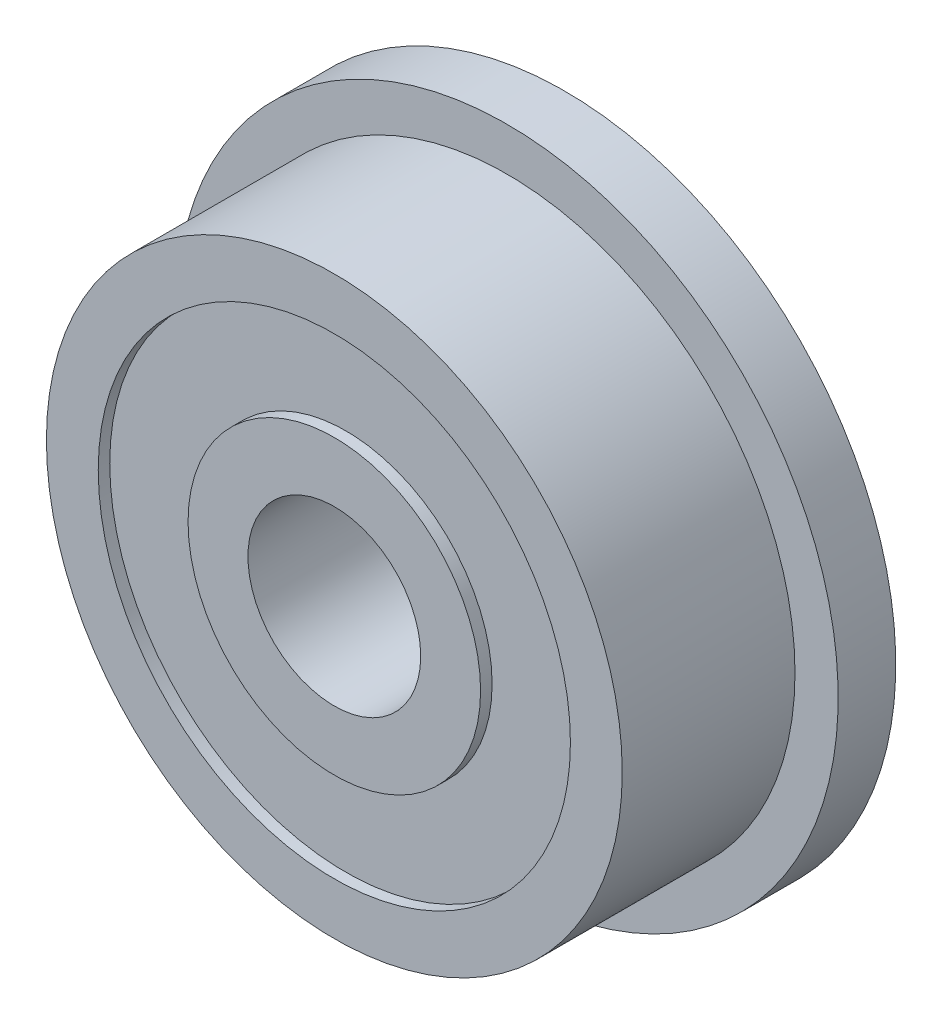
ISO-10303-21;
HEADER;
FILE_DESCRIPTION(('STEP AP214'),'2;1');
FILE_NAME('part.step','',(''),(''),'','','');
FILE_SCHEMA(('AUTOMOTIVE_DESIGN { 1 0 10303 214 1 1 1 1 }'));
ENDSEC;
DATA;
#1=APPLICATION_CONTEXT('core data for automotive mechanical design processes');
#2=APPLICATION_PROTOCOL_DEFINITION('international standard','automotive_design',2000,#1);
#3=PRODUCT_CONTEXT('',#1,'mechanical');
#4=PRODUCT('Part','Part','',(#3));
#5=PRODUCT_RELATED_PRODUCT_CATEGORY('part','',(#4));
#6=PRODUCT_DEFINITION_FORMATION('','',#4);
#7=PRODUCT_DEFINITION_CONTEXT('part definition',#1,'design');
#8=PRODUCT_DEFINITION('design','',#6,#7);
#9=PRODUCT_DEFINITION_SHAPE('','',#8);
#10=(LENGTH_UNIT() NAMED_UNIT(*) SI_UNIT(.MILLI.,.METRE.));
#11=(NAMED_UNIT(*) PLANE_ANGLE_UNIT() SI_UNIT($,.RADIAN.));
#12=(NAMED_UNIT(*) SI_UNIT($,.STERADIAN.) SOLID_ANGLE_UNIT());
#13=UNCERTAINTY_MEASURE_WITH_UNIT(LENGTH_MEASURE(1.E-05),#10,'distance_accuracy_value','');
#14=(GEOMETRIC_REPRESENTATION_CONTEXT(3) GLOBAL_UNCERTAINTY_ASSIGNED_CONTEXT((#13)) GLOBAL_UNIT_ASSIGNED_CONTEXT((#10,
#11,#12)) REPRESENTATION_CONTEXT('',''));
#15=CARTESIAN_POINT('',(0.,0.,0.));
#16=DIRECTION('',(0.,0.,1.));
#17=DIRECTION('',(1.,0.,0.));
#18=AXIS2_PLACEMENT_3D('',#15,#16,#17);
#19=CARTESIAN_POINT('',(0.,0.,-2.));
#20=DIRECTION('',(0.,0.,1.));
#21=DIRECTION('',(1.,0.,0.));
#22=AXIS2_PLACEMENT_3D('',#19,#20,#21);
#23=PLANE('',#22);
#24=CARTESIAN_POINT('',(0.,0.,-2.));
#25=DIRECTION('',(0.,0.,1.));
#26=DIRECTION('',(1.,0.,0.));
#27=AXIS2_PLACEMENT_3D('',#24,#25,#26);
#28=CIRCLE('',#27,1.5);
#29=CARTESIAN_POINT('',(1.5,0.,-2.));
#30=VERTEX_POINT('',#29);
#31=EDGE_CURVE('E49',#30,#30,#28,.T.);
#32=ORIENTED_EDGE('',*,*,#31,.T.);
#33=EDGE_LOOP('',(#32));
#34=FACE_BOUND('',#33,.T.);
#35=CARTESIAN_POINT('',(0.,0.,-2.));
#36=DIRECTION('',(0.,0.,1.));
#37=DIRECTION('',(1.,0.,0.));
#38=AXIS2_PLACEMENT_3D('',#35,#36,#37);
#39=CIRCLE('',#38,2.54);
#40=CARTESIAN_POINT('',(2.54,0.,-2.));
#41=VERTEX_POINT('',#40);
#42=EDGE_CURVE('E75',#41,#41,#39,.T.);
#43=ORIENTED_EDGE('',*,*,#42,.F.);
#44=EDGE_LOOP('',(#43));
#45=FACE_BOUND('',#44,.T.);
#46=ADVANCED_FACE('F30',(#34,#45),#23,.F.);
#47=CARTESIAN_POINT('',(0.,0.,2.));
#48=DIRECTION('',(0.,0.,1.));
#49=DIRECTION('',(1.,0.,0.));
#50=AXIS2_PLACEMENT_3D('',#47,#48,#49);
#51=PLANE('',#50);
#52=CARTESIAN_POINT('',(0.,0.,2.));
#53=DIRECTION('',(0.,0.,1.));
#54=DIRECTION('',(1.,0.,0.));
#55=AXIS2_PLACEMENT_3D('',#52,#53,#54);
#56=CIRCLE('',#55,1.5);
#57=CARTESIAN_POINT('',(1.5,0.,2.));
#58=VERTEX_POINT('',#57);
#59=EDGE_CURVE('E51',#58,#58,#56,.T.);
#60=ORIENTED_EDGE('',*,*,#59,.F.);
#61=EDGE_LOOP('',(#60));
#62=FACE_BOUND('',#61,.T.);
#63=CARTESIAN_POINT('',(0.,0.,2.));
#64=DIRECTION('',(0.,0.,1.));
#65=DIRECTION('',(1.,0.,0.));
#66=AXIS2_PLACEMENT_3D('',#63,#64,#65);
#67=CIRCLE('',#66,2.54);
#68=CARTESIAN_POINT('',(2.54,0.,2.));
#69=VERTEX_POINT('',#68);
#70=EDGE_CURVE('E63',#69,#69,#67,.T.);
#71=ORIENTED_EDGE('',*,*,#70,.T.);
#72=EDGE_LOOP('',(#71));
#73=FACE_BOUND('',#72,.T.);
#74=ADVANCED_FACE('F91',(#62,#73),#51,.T.);
#75=CARTESIAN_POINT('',(0.,0.,2.));
#76=DIRECTION('',(0.,0.,-1.));
#77=DIRECTION('',(-1.,0.,0.));
#78=AXIS2_PLACEMENT_3D('',#75,#76,#77);
#79=CYLINDRICAL_SURFACE('',#78,5.);
#80=CARTESIAN_POINT('',(0.,0.,2.));
#81=DIRECTION('',(0.,0.,1.));
#82=DIRECTION('',(1.,0.,0.));
#83=AXIS2_PLACEMENT_3D('',#80,#81,#82);
#84=CIRCLE('',#83,5.);
#85=CARTESIAN_POINT('',(5.,0.,2.));
#86=VERTEX_POINT('',#85);
#87=EDGE_CURVE('E37',#86,#86,#84,.T.);
#88=ORIENTED_EDGE('',*,*,#87,.F.);
#89=EDGE_LOOP('',(#88));
#90=FACE_BOUND('',#89,.T.);
#91=CARTESIAN_POINT('',(0.,0.,-1.));
#92=DIRECTION('',(0.,0.,-1.));
#93=DIRECTION('',(-1.,0.,0.));
#94=AXIS2_PLACEMENT_3D('',#91,#92,#93);
#95=CIRCLE('',#94,5.);
#96=CARTESIAN_POINT('',(-5.,0.,-1.));
#97=VERTEX_POINT('',#96);
#98=EDGE_CURVE('E10',#97,#97,#95,.T.);
#99=ORIENTED_EDGE('',*,*,#98,.F.);
#100=EDGE_LOOP('',(#99));
#101=FACE_BOUND('',#100,.T.);
#102=ADVANCED_FACE('F32',(#90,#101),#79,.T.);
#103=CARTESIAN_POINT('',(0.,0.,2.));
#104=DIRECTION('',(0.,0.,1.));
#105=DIRECTION('',(1.,0.,0.));
#106=AXIS2_PLACEMENT_3D('',#103,#104,#105);
#107=CIRCLE('',#106,4.1);
#108=CARTESIAN_POINT('',(4.1,0.,2.));
#109=VERTEX_POINT('',#108);
#110=EDGE_CURVE('E57',#109,#109,#107,.T.);
#111=ORIENTED_EDGE('',*,*,#110,.F.);
#112=EDGE_LOOP('',(#111));
#113=FACE_BOUND('',#112,.T.);
#114=ORIENTED_EDGE('',*,*,#87,.T.);
#115=EDGE_LOOP('',(#114));
#116=FACE_BOUND('',#115,.T.);
#117=ADVANCED_FACE('F99',(#113,#116),#51,.T.);
#118=CARTESIAN_POINT('',(0.,0.,-1.));
#119=DIRECTION('',(0.,0.,-1.));
#120=DIRECTION('',(-1.,0.,0.));
#121=AXIS2_PLACEMENT_3D('',#118,#119,#120);
#122=CYLINDRICAL_SURFACE('',#121,5.75);
#123=CARTESIAN_POINT('',(0.,0.,-1.));
#124=DIRECTION('',(0.,0.,-1.));
#125=DIRECTION('',(-1.,0.,0.));
#126=AXIS2_PLACEMENT_3D('',#123,#124,#125);
#127=CIRCLE('',#126,5.75);
#128=CARTESIAN_POINT('',(-5.75,0.,-1.));
#129=VERTEX_POINT('',#128);
#130=EDGE_CURVE('E41',#129,#129,#127,.T.);
#131=ORIENTED_EDGE('',*,*,#130,.T.);
#132=EDGE_LOOP('',(#131));
#133=FACE_BOUND('',#132,.T.);
#134=CARTESIAN_POINT('',(0.,0.,-2.));
#135=DIRECTION('',(0.,0.,-1.));
#136=DIRECTION('',(-1.,0.,0.));
#137=AXIS2_PLACEMENT_3D('',#134,#135,#136);
#138=CIRCLE('',#137,5.75);
#139=CARTESIAN_POINT('',(-5.75,0.,-2.));
#140=VERTEX_POINT('',#139);
#141=EDGE_CURVE('E45',#140,#140,#138,.T.);
#142=ORIENTED_EDGE('',*,*,#141,.F.);
#143=EDGE_LOOP('',(#142));
#144=FACE_BOUND('',#143,.T.);
#145=ADVANCED_FACE('F111',(#133,#144),#122,.T.);
#146=CARTESIAN_POINT('',(0.,0.,-1.));
#147=DIRECTION('',(0.,0.,-1.));
#148=DIRECTION('',(-1.,0.,0.));
#149=AXIS2_PLACEMENT_3D('',#146,#147,#148);
#150=PLANE('',#149);
#151=ORIENTED_EDGE('',*,*,#98,.T.);
#152=EDGE_LOOP('',(#151));
#153=FACE_BOUND('',#152,.T.);
#154=ORIENTED_EDGE('',*,*,#130,.F.);
#155=EDGE_LOOP('',(#154));
#156=FACE_BOUND('',#155,.T.);
#157=ADVANCED_FACE('F102',(#153,#156),#150,.F.);
#158=CARTESIAN_POINT('',(0.,0.,-2.));
#159=DIRECTION('',(0.,0.,1.));
#160=DIRECTION('',(1.,0.,0.));
#161=AXIS2_PLACEMENT_3D('',#158,#159,#160);
#162=CIRCLE('',#161,4.1);
#163=CARTESIAN_POINT('',(4.1,0.,-2.));
#164=VERTEX_POINT('',#163);
#165=EDGE_CURVE('E69',#164,#164,#162,.T.);
#166=ORIENTED_EDGE('',*,*,#165,.T.);
#167=EDGE_LOOP('',(#166));
#168=FACE_BOUND('',#167,.T.);
#169=ORIENTED_EDGE('',*,*,#141,.T.);
#170=EDGE_LOOP('',(#169));
#171=FACE_BOUND('',#170,.T.);
#172=ADVANCED_FACE('F93',(#168,#171),#23,.F.);
#173=CARTESIAN_POINT('',(0.,0.,-2.));
#174=DIRECTION('',(0.,0.,1.));
#175=DIRECTION('',(1.,0.,0.));
#176=AXIS2_PLACEMENT_3D('',#173,#174,#175);
#177=CYLINDRICAL_SURFACE('',#176,1.5);
#178=ORIENTED_EDGE('',*,*,#31,.F.);
#179=EDGE_LOOP('',(#178));
#180=FACE_BOUND('',#179,.T.);
#181=ORIENTED_EDGE('',*,*,#59,.T.);
#182=EDGE_LOOP('',(#181));
#183=FACE_BOUND('',#182,.T.);
#184=ADVANCED_FACE('F101',(#180,#183),#177,.F.);
#185=CARTESIAN_POINT('',(0.,0.,1.8));
#186=DIRECTION('',(0.,0.,1.));
#187=DIRECTION('',(1.,0.,0.));
#188=AXIS2_PLACEMENT_3D('',#185,#186,#187);
#189=CYLINDRICAL_SURFACE('',#188,4.1);
#190=CARTESIAN_POINT('',(0.,0.,1.8));
#191=DIRECTION('',(0.,0.,1.));
#192=DIRECTION('',(1.,0.,0.));
#193=AXIS2_PLACEMENT_3D('',#190,#191,#192);
#194=CIRCLE('',#193,4.1);
#195=CARTESIAN_POINT('',(4.1,0.,1.8));
#196=VERTEX_POINT('',#195);
#197=EDGE_CURVE('E54',#196,#196,#194,.T.);
#198=ORIENTED_EDGE('',*,*,#197,.F.);
#199=EDGE_LOOP('',(#198));
#200=FACE_BOUND('',#199,.T.);
#201=ORIENTED_EDGE('',*,*,#110,.T.);
#202=EDGE_LOOP('',(#201));
#203=FACE_BOUND('',#202,.T.);
#204=ADVANCED_FACE('F108',(#200,#203),#189,.F.);
#205=CARTESIAN_POINT('',(0.,0.,1.8));
#206=DIRECTION('',(0.,0.,1.));
#207=DIRECTION('',(1.,0.,0.));
#208=AXIS2_PLACEMENT_3D('',#205,#206,#207);
#209=PLANE('',#208);
#210=CARTESIAN_POINT('',(0.,0.,1.8));
#211=DIRECTION('',(0.,0.,1.));
#212=DIRECTION('',(1.,0.,0.));
#213=AXIS2_PLACEMENT_3D('',#210,#211,#212);
#214=CIRCLE('',#213,2.54);
#215=CARTESIAN_POINT('',(2.54,0.,1.8));
#216=VERTEX_POINT('',#215);
#217=EDGE_CURVE('E60',#216,#216,#214,.T.);
#218=ORIENTED_EDGE('',*,*,#217,.F.);
#219=EDGE_LOOP('',(#218));
#220=FACE_BOUND('',#219,.T.);
#221=ORIENTED_EDGE('',*,*,#197,.T.);
#222=EDGE_LOOP('',(#221));
#223=FACE_BOUND('',#222,.T.);
#224=ADVANCED_FACE('F127',(#220,#223),#209,.T.);
#225=CARTESIAN_POINT('',(0.,0.,1.8));
#226=DIRECTION('',(0.,0.,1.));
#227=DIRECTION('',(1.,0.,0.));
#228=AXIS2_PLACEMENT_3D('',#225,#226,#227);
#229=CYLINDRICAL_SURFACE('',#228,2.54);
#230=ORIENTED_EDGE('',*,*,#217,.T.);
#231=EDGE_LOOP('',(#230));
#232=FACE_BOUND('',#231,.T.);
#233=ORIENTED_EDGE('',*,*,#70,.F.);
#234=EDGE_LOOP('',(#233));
#235=FACE_BOUND('',#234,.T.);
#236=ADVANCED_FACE('F131',(#232,#235),#229,.T.);
#237=CARTESIAN_POINT('',(0.,0.,-1.8));
#238=DIRECTION('',(0.,0.,-1.));
#239=DIRECTION('',(1.,0.,0.));
#240=AXIS2_PLACEMENT_3D('',#237,#238,#239);
#241=PLANE('',#240);
#242=CARTESIAN_POINT('',(0.,0.,-1.8));
#243=DIRECTION('',(0.,0.,1.));
#244=DIRECTION('',(1.,0.,0.));
#245=AXIS2_PLACEMENT_3D('',#242,#243,#244);
#246=CIRCLE('',#245,4.1);
#247=CARTESIAN_POINT('',(4.1,0.,-1.8));
#248=VERTEX_POINT('',#247);
#249=EDGE_CURVE('E66',#248,#248,#246,.T.);
#250=ORIENTED_EDGE('',*,*,#249,.F.);
#251=EDGE_LOOP('',(#250));
#252=FACE_BOUND('',#251,.T.);
#253=CARTESIAN_POINT('',(0.,0.,-1.8));
#254=DIRECTION('',(0.,0.,1.));
#255=DIRECTION('',(1.,0.,0.));
#256=AXIS2_PLACEMENT_3D('',#253,#254,#255);
#257=CIRCLE('',#256,2.54);
#258=CARTESIAN_POINT('',(2.54,0.,-1.8));
#259=VERTEX_POINT('',#258);
#260=EDGE_CURVE('E72',#259,#259,#257,.T.);
#261=ORIENTED_EDGE('',*,*,#260,.T.);
#262=EDGE_LOOP('',(#261));
#263=FACE_BOUND('',#262,.T.);
#264=ADVANCED_FACE('F81',(#252,#263),#241,.T.);
#265=CARTESIAN_POINT('',(0.,0.,-1.8));
#266=DIRECTION('',(0.,0.,-1.));
#267=DIRECTION('',(-1.,0.,0.));
#268=AXIS2_PLACEMENT_3D('',#265,#266,#267);
#269=CYLINDRICAL_SURFACE('',#268,4.1);
#270=ORIENTED_EDGE('',*,*,#249,.T.);
#271=EDGE_LOOP('',(#270));
#272=FACE_BOUND('',#271,.T.);
#273=ORIENTED_EDGE('',*,*,#165,.F.);
#274=EDGE_LOOP('',(#273));
#275=FACE_BOUND('',#274,.T.);
#276=ADVANCED_FACE('F86',(#272,#275),#269,.F.);
#277=CARTESIAN_POINT('',(0.,0.,-1.8));
#278=DIRECTION('',(0.,0.,-1.));
#279=DIRECTION('',(-1.,0.,0.));
#280=AXIS2_PLACEMENT_3D('',#277,#278,#279);
#281=CYLINDRICAL_SURFACE('',#280,2.54);
#282=ORIENTED_EDGE('',*,*,#260,.F.);
#283=EDGE_LOOP('',(#282));
#284=FACE_BOUND('',#283,.T.);
#285=ORIENTED_EDGE('',*,*,#42,.T.);
#286=EDGE_LOOP('',(#285));
#287=FACE_BOUND('',#286,.T.);
#288=ADVANCED_FACE('F83',(#284,#287),#281,.T.);
#289=CLOSED_SHELL('',(#46,#74,#102,#117,#145,#157,#172,#184,#204,#224,#236,#264,#276,#288));
#290=MANIFOLD_SOLID_BREP('B2',#289);
#291=ADVANCED_BREP_SHAPE_REPRESENTATION('',(#18,#290),#14);
#292=SHAPE_DEFINITION_REPRESENTATION(#9,#291);
ENDSEC;
END-ISO-10303-21;
